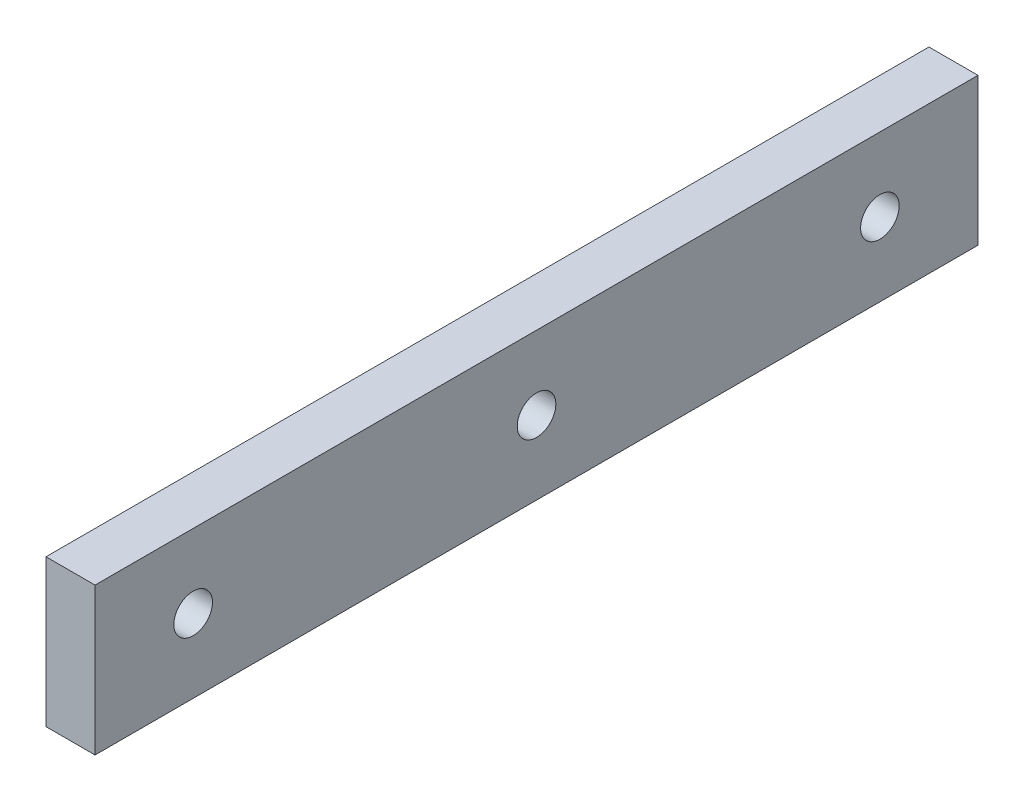
ISO-10303-21;
HEADER;
FILE_DESCRIPTION(('STEP AP214'),'2;1');
FILE_NAME('part.step','',(''),(''),'','','');
FILE_SCHEMA(('AUTOMOTIVE_DESIGN { 1 0 10303 214 1 1 1 1 }'));
ENDSEC;
DATA;
#1=APPLICATION_CONTEXT('core data for automotive mechanical design processes');
#2=APPLICATION_PROTOCOL_DEFINITION('international standard','automotive_design',2000,#1);
#3=PRODUCT_CONTEXT('',#1,'mechanical');
#4=PRODUCT('Part','Part','',(#3));
#5=PRODUCT_RELATED_PRODUCT_CATEGORY('part','',(#4));
#6=PRODUCT_DEFINITION_FORMATION('','',#4);
#7=PRODUCT_DEFINITION_CONTEXT('part definition',#1,'design');
#8=PRODUCT_DEFINITION('design','',#6,#7);
#9=PRODUCT_DEFINITION_SHAPE('','',#8);
#10=(LENGTH_UNIT() NAMED_UNIT(*) SI_UNIT(.MILLI.,.METRE.));
#11=(NAMED_UNIT(*) PLANE_ANGLE_UNIT() SI_UNIT($,.RADIAN.));
#12=(NAMED_UNIT(*) SI_UNIT($,.STERADIAN.) SOLID_ANGLE_UNIT());
#13=UNCERTAINTY_MEASURE_WITH_UNIT(LENGTH_MEASURE(1.E-05),#10,'distance_accuracy_value','');
#14=(GEOMETRIC_REPRESENTATION_CONTEXT(3) GLOBAL_UNCERTAINTY_ASSIGNED_CONTEXT((#13)) GLOBAL_UNIT_ASSIGNED_CONTEXT((#10,
#11,#12)) REPRESENTATION_CONTEXT('',''));
#15=CARTESIAN_POINT('',(0.,0.,0.));
#16=DIRECTION('',(0.,0.,1.));
#17=DIRECTION('',(1.,0.,0.));
#18=AXIS2_PLACEMENT_3D('',#15,#16,#17);
#19=CARTESIAN_POINT('',(3.175,9.525,57.15));
#20=DIRECTION('',(-1.,0.,0.));
#21=DIRECTION('',(0.,-1.,0.));
#22=AXIS2_PLACEMENT_3D('',#19,#20,#21);
#23=PLANE('',#22);
#24=CARTESIAN_POINT('',(3.175,0.,0.));
#25=DIRECTION('',(1.,0.,0.));
#26=DIRECTION('',(0.,0.,-1.));
#27=AXIS2_PLACEMENT_3D('',#24,#25,#26);
#28=CIRCLE('',#27,2.49999999999999);
#29=CARTESIAN_POINT('',(3.175,0.,-2.49999999999999));
#30=VERTEX_POINT('',#29);
#31=EDGE_CURVE('E150',#30,#30,#28,.T.);
#32=ORIENTED_EDGE('',*,*,#31,.F.);
#33=EDGE_LOOP('',(#32));
#34=FACE_BOUND('',#33,.T.);
#35=CARTESIAN_POINT('',(3.175,0.,-44.45));
#36=DIRECTION('',(1.,0.,0.));
#37=DIRECTION('',(0.,0.,-1.));
#38=AXIS2_PLACEMENT_3D('',#35,#36,#37);
#39=CIRCLE('',#38,2.49999999999999);
#40=CARTESIAN_POINT('',(3.175,0.,-46.95));
#41=VERTEX_POINT('',#40);
#42=EDGE_CURVE('E134',#41,#41,#39,.T.);
#43=ORIENTED_EDGE('',*,*,#42,.F.);
#44=EDGE_LOOP('',(#43));
#45=FACE_BOUND('',#44,.T.);
#46=DIRECTION('',(0.,1.,0.));
#47=VECTOR('',#46,1.);
#48=CARTESIAN_POINT('',(3.175,9.525,-57.15));
#49=LINE('',#48,#47);
#50=CARTESIAN_POINT('',(3.175,-9.525,-57.15));
#51=VERTEX_POINT('',#50);
#52=CARTESIAN_POINT('',(3.175,9.525,-57.15));
#53=VERTEX_POINT('',#52);
#54=EDGE_CURVE('E109',#51,#53,#49,.T.);
#55=ORIENTED_EDGE('',*,*,#54,.T.);
#56=DIRECTION('',(0.,0.,-1.));
#57=VECTOR('',#56,1.);
#58=CARTESIAN_POINT('',(3.175,9.525,57.15));
#59=LINE('',#58,#57);
#60=CARTESIAN_POINT('',(3.175,9.525,57.15));
#61=VERTEX_POINT('',#60);
#62=EDGE_CURVE('E11',#61,#53,#59,.T.);
#63=ORIENTED_EDGE('',*,*,#62,.F.);
#64=DIRECTION('',(0.,1.,0.));
#65=VECTOR('',#64,1.);
#66=CARTESIAN_POINT('',(3.175,9.525,57.15));
#67=LINE('',#66,#65);
#68=CARTESIAN_POINT('',(3.175,-9.525,57.15));
#69=VERTEX_POINT('',#68);
#70=EDGE_CURVE('E93',#69,#61,#67,.T.);
#71=ORIENTED_EDGE('',*,*,#70,.F.);
#72=DIRECTION('',(0.,0.,-1.));
#73=VECTOR('',#72,1.);
#74=CARTESIAN_POINT('',(3.175,-9.525,57.15));
#75=LINE('',#74,#73);
#76=EDGE_CURVE('E105',#69,#51,#75,.T.);
#77=ORIENTED_EDGE('',*,*,#76,.T.);
#78=EDGE_LOOP('',(#55,#63,#71,#77));
#79=FACE_BOUND('',#78,.T.);
#80=CARTESIAN_POINT('',(3.175,0.,44.45));
#81=DIRECTION('',(1.,0.,0.));
#82=DIRECTION('',(0.,0.,-1.));
#83=AXIS2_PLACEMENT_3D('',#80,#81,#82);
#84=CIRCLE('',#83,2.49999999999999);
#85=CARTESIAN_POINT('',(3.175,0.,41.95));
#86=VERTEX_POINT('',#85);
#87=EDGE_CURVE('E142',#86,#86,#84,.T.);
#88=ORIENTED_EDGE('',*,*,#87,.F.);
#89=EDGE_LOOP('',(#88));
#90=FACE_BOUND('',#89,.T.);
#91=ADVANCED_FACE('F41',(#34,#45,#79,#90),#23,.F.);
#92=CARTESIAN_POINT('',(-3.175,9.525,57.15));
#93=DIRECTION('',(0.,-1.,0.));
#94=DIRECTION('',(0.,0.,-1.));
#95=AXIS2_PLACEMENT_3D('',#92,#93,#94);
#96=PLANE('',#95);
#97=DIRECTION('',(-1.,0.,0.));
#98=VECTOR('',#97,1.);
#99=CARTESIAN_POINT('',(-3.175,9.525,-57.15));
#100=LINE('',#99,#98);
#101=CARTESIAN_POINT('',(-3.175,9.525,-57.15));
#102=VERTEX_POINT('',#101);
#103=EDGE_CURVE('E98',#53,#102,#100,.T.);
#104=ORIENTED_EDGE('',*,*,#103,.T.);
#105=DIRECTION('',(0.,0.,-1.));
#106=VECTOR('',#105,1.);
#107=CARTESIAN_POINT('',(-3.175,9.525,57.15));
#108=LINE('',#107,#106);
#109=CARTESIAN_POINT('',(-3.175,9.525,57.15));
#110=VERTEX_POINT('',#109);
#111=EDGE_CURVE('E50',#110,#102,#108,.T.);
#112=ORIENTED_EDGE('',*,*,#111,.F.);
#113=DIRECTION('',(-1.,0.,0.));
#114=VECTOR('',#113,1.);
#115=CARTESIAN_POINT('',(-3.175,9.525,57.15));
#116=LINE('',#115,#114);
#117=EDGE_CURVE('E88',#61,#110,#116,.T.);
#118=ORIENTED_EDGE('',*,*,#117,.F.);
#119=ORIENTED_EDGE('',*,*,#62,.T.);
#120=EDGE_LOOP('',(#104,#112,#118,#119));
#121=FACE_BOUND('',#120,.T.);
#122=ADVANCED_FACE('F97',(#121),#96,.F.);
#123=CARTESIAN_POINT('',(-3.175,9.525,57.15));
#124=DIRECTION('',(1.,0.,0.));
#125=DIRECTION('',(0.,1.,0.));
#126=AXIS2_PLACEMENT_3D('',#123,#124,#125);
#127=PLANE('',#126);
#128=CARTESIAN_POINT('',(-3.175,0.,0.));
#129=DIRECTION('',(1.,0.,0.));
#130=DIRECTION('',(0.,0.,-1.));
#131=AXIS2_PLACEMENT_3D('',#128,#129,#130);
#132=CIRCLE('',#131,2.49999999999999);
#133=CARTESIAN_POINT('',(-3.175,0.,-2.49999999999999));
#134=VERTEX_POINT('',#133);
#135=EDGE_CURVE('E146',#134,#134,#132,.T.);
#136=ORIENTED_EDGE('',*,*,#135,.T.);
#137=EDGE_LOOP('',(#136));
#138=FACE_BOUND('',#137,.T.);
#139=CARTESIAN_POINT('',(-3.175,0.,44.45));
#140=DIRECTION('',(1.,0.,0.));
#141=DIRECTION('',(0.,1.,0.));
#142=AXIS2_PLACEMENT_3D('',#139,#140,#141);
#143=CIRCLE('',#142,2.49999999999999);
#144=CARTESIAN_POINT('',(-3.175,2.49999999999999,44.45));
#145=VERTEX_POINT('',#144);
#146=EDGE_CURVE('E138',#145,#145,#143,.T.);
#147=ORIENTED_EDGE('',*,*,#146,.T.);
#148=EDGE_LOOP('',(#147));
#149=FACE_BOUND('',#148,.T.);
#150=CARTESIAN_POINT('',(-3.175,0.,-44.45));
#151=DIRECTION('',(1.,0.,0.));
#152=DIRECTION('',(0.,1.,0.));
#153=AXIS2_PLACEMENT_3D('',#150,#151,#152);
#154=CIRCLE('',#153,2.49999999999999);
#155=CARTESIAN_POINT('',(-3.175,2.49999999999999,-44.45));
#156=VERTEX_POINT('',#155);
#157=EDGE_CURVE('E113',#156,#156,#154,.T.);
#158=ORIENTED_EDGE('',*,*,#157,.T.);
#159=EDGE_LOOP('',(#158));
#160=FACE_BOUND('',#159,.T.);
#161=DIRECTION('',(0.,-1.,0.));
#162=VECTOR('',#161,1.);
#163=CARTESIAN_POINT('',(-3.175,9.525,-57.15));
#164=LINE('',#163,#162);
#165=CARTESIAN_POINT('',(-3.175,-9.525,-57.15));
#166=VERTEX_POINT('',#165);
#167=EDGE_CURVE('E75',#102,#166,#164,.T.);
#168=ORIENTED_EDGE('',*,*,#167,.T.);
#169=DIRECTION('',(0.,0.,-1.));
#170=VECTOR('',#169,1.);
#171=CARTESIAN_POINT('',(-3.175,-9.525,57.15));
#172=LINE('',#171,#170);
#173=CARTESIAN_POINT('',(-3.175,-9.525,57.15));
#174=VERTEX_POINT('',#173);
#175=EDGE_CURVE('E100',#174,#166,#172,.T.);
#176=ORIENTED_EDGE('',*,*,#175,.F.);
#177=DIRECTION('',(0.,-1.,0.));
#178=VECTOR('',#177,1.);
#179=CARTESIAN_POINT('',(-3.175,9.525,57.15));
#180=LINE('',#179,#178);
#181=EDGE_CURVE('E91',#110,#174,#180,.T.);
#182=ORIENTED_EDGE('',*,*,#181,.F.);
#183=ORIENTED_EDGE('',*,*,#111,.T.);
#184=EDGE_LOOP('',(#168,#176,#182,#183));
#185=FACE_BOUND('',#184,.T.);
#186=ADVANCED_FACE('F101',(#138,#149,#160,#185),#127,.F.);
#187=CARTESIAN_POINT('',(-3.175,-9.525,57.15));
#188=DIRECTION('',(0.,1.,0.));
#189=DIRECTION('',(0.,0.,1.));
#190=AXIS2_PLACEMENT_3D('',#187,#188,#189);
#191=PLANE('',#190);
#192=DIRECTION('',(1.,0.,0.));
#193=VECTOR('',#192,1.);
#194=CARTESIAN_POINT('',(-3.175,-9.525,-57.15));
#195=LINE('',#194,#193);
#196=EDGE_CURVE('E81',#166,#51,#195,.T.);
#197=ORIENTED_EDGE('',*,*,#196,.T.);
#198=ORIENTED_EDGE('',*,*,#76,.F.);
#199=DIRECTION('',(1.,0.,0.));
#200=VECTOR('',#199,1.);
#201=CARTESIAN_POINT('',(-3.175,-9.525,57.15));
#202=LINE('',#201,#200);
#203=EDGE_CURVE('E58',#174,#69,#202,.T.);
#204=ORIENTED_EDGE('',*,*,#203,.F.);
#205=ORIENTED_EDGE('',*,*,#175,.T.);
#206=EDGE_LOOP('',(#197,#198,#204,#205));
#207=FACE_BOUND('',#206,.T.);
#208=ADVANCED_FACE('F123',(#207),#191,.F.);
#209=CARTESIAN_POINT('',(3.175,-9.525,57.15));
#210=DIRECTION('',(0.,0.,1.));
#211=DIRECTION('',(1.,0.,0.));
#212=AXIS2_PLACEMENT_3D('',#209,#210,#211);
#213=PLANE('',#212);
#214=ORIENTED_EDGE('',*,*,#70,.T.);
#215=ORIENTED_EDGE('',*,*,#117,.T.);
#216=ORIENTED_EDGE('',*,*,#181,.T.);
#217=ORIENTED_EDGE('',*,*,#203,.T.);
#218=EDGE_LOOP('',(#214,#215,#216,#217));
#219=FACE_BOUND('',#218,.T.);
#220=ADVANCED_FACE('F89',(#219),#213,.T.);
#221=CARTESIAN_POINT('',(3.175,-9.525,-57.15));
#222=DIRECTION('',(0.,0.,1.));
#223=DIRECTION('',(1.,0.,0.));
#224=AXIS2_PLACEMENT_3D('',#221,#222,#223);
#225=PLANE('',#224);
#226=ORIENTED_EDGE('',*,*,#54,.F.);
#227=ORIENTED_EDGE('',*,*,#196,.F.);
#228=ORIENTED_EDGE('',*,*,#167,.F.);
#229=ORIENTED_EDGE('',*,*,#103,.F.);
#230=EDGE_LOOP('',(#226,#227,#228,#229));
#231=FACE_BOUND('',#230,.T.);
#232=ADVANCED_FACE('F126',(#231),#225,.F.);
#233=CARTESIAN_POINT('',(3.175,0.,-44.45));
#234=DIRECTION('',(1.,0.,0.));
#235=DIRECTION('',(0.,0.,-1.));
#236=AXIS2_PLACEMENT_3D('',#233,#234,#235);
#237=CYLINDRICAL_SURFACE('',#236,2.49999999999999);
#238=ORIENTED_EDGE('',*,*,#157,.F.);
#239=EDGE_LOOP('',(#238));
#240=FACE_BOUND('',#239,.T.);
#241=ORIENTED_EDGE('',*,*,#42,.T.);
#242=EDGE_LOOP('',(#241));
#243=FACE_BOUND('',#242,.T.);
#244=ADVANCED_FACE('F161',(#240,#243),#237,.F.);
#245=CARTESIAN_POINT('',(3.175,0.,44.45));
#246=DIRECTION('',(1.,0.,0.));
#247=DIRECTION('',(0.,0.,-1.));
#248=AXIS2_PLACEMENT_3D('',#245,#246,#247);
#249=CYLINDRICAL_SURFACE('',#248,2.49999999999999);
#250=ORIENTED_EDGE('',*,*,#146,.F.);
#251=EDGE_LOOP('',(#250));
#252=FACE_BOUND('',#251,.T.);
#253=ORIENTED_EDGE('',*,*,#87,.T.);
#254=EDGE_LOOP('',(#253));
#255=FACE_BOUND('',#254,.T.);
#256=ADVANCED_FACE('F163',(#252,#255),#249,.F.);
#257=CARTESIAN_POINT('',(3.175,0.,0.));
#258=DIRECTION('',(1.,0.,0.));
#259=DIRECTION('',(0.,0.,-1.));
#260=AXIS2_PLACEMENT_3D('',#257,#258,#259);
#261=CYLINDRICAL_SURFACE('',#260,2.49999999999999);
#262=ORIENTED_EDGE('',*,*,#135,.F.);
#263=EDGE_LOOP('',(#262));
#264=FACE_BOUND('',#263,.T.);
#265=ORIENTED_EDGE('',*,*,#31,.T.);
#266=EDGE_LOOP('',(#265));
#267=FACE_BOUND('',#266,.T.);
#268=ADVANCED_FACE('F155',(#264,#267),#261,.F.);
#269=CLOSED_SHELL('',(#91,#122,#186,#208,#220,#232,#244,#256,#268));
#270=MANIFOLD_SOLID_BREP('B2',#269);
#271=ADVANCED_BREP_SHAPE_REPRESENTATION('',(#18,#270),#14);
#272=SHAPE_DEFINITION_REPRESENTATION(#9,#271);
ENDSEC;
END-ISO-10303-21;
